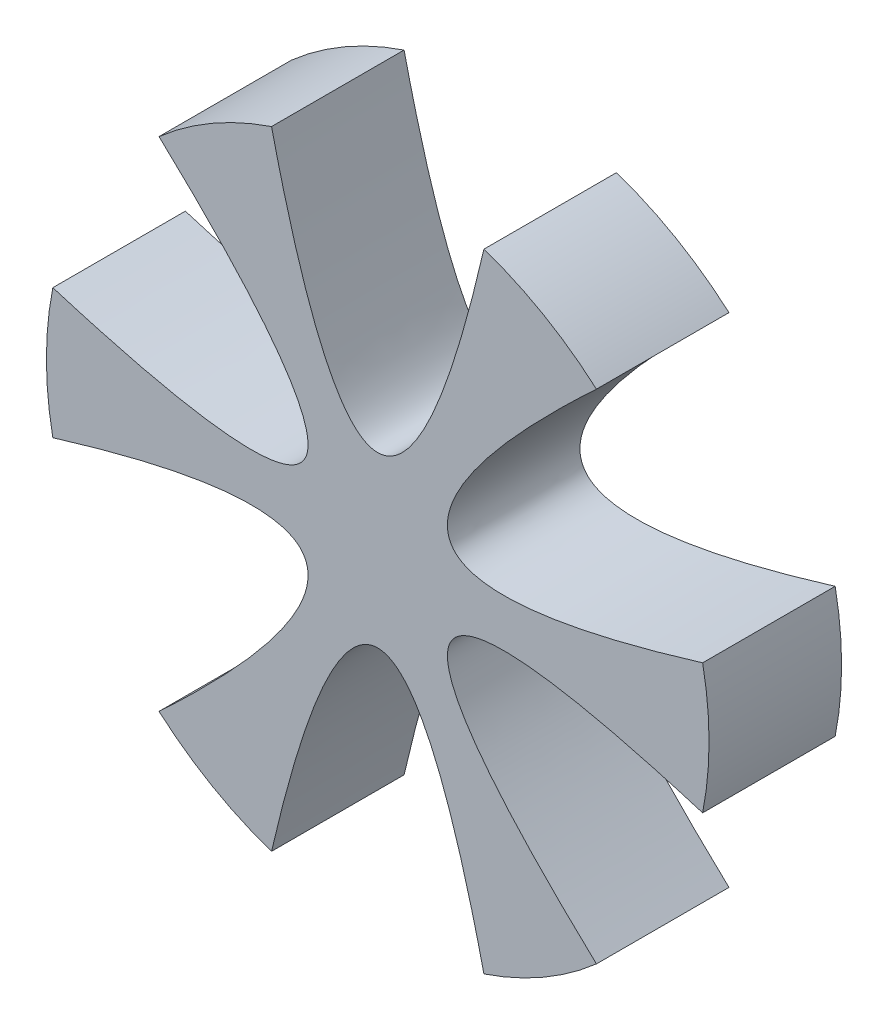
ISO-10303-21;
HEADER;
FILE_DESCRIPTION(('STEP AP214'),'2;1');
FILE_NAME('part.step','',(''),(''),'','','');
FILE_SCHEMA(('AUTOMOTIVE_DESIGN { 1 0 10303 214 1 1 1 1 }'));
ENDSEC;
DATA;
#1=APPLICATION_CONTEXT('core data for automotive mechanical design processes');
#2=APPLICATION_PROTOCOL_DEFINITION('international standard','automotive_design',2000,#1);
#3=PRODUCT_CONTEXT('',#1,'mechanical');
#4=PRODUCT('Part','Part','',(#3));
#5=PRODUCT_RELATED_PRODUCT_CATEGORY('part','',(#4));
#6=PRODUCT_DEFINITION_FORMATION('','',#4);
#7=PRODUCT_DEFINITION_CONTEXT('part definition',#1,'design');
#8=PRODUCT_DEFINITION('design','',#6,#7);
#9=PRODUCT_DEFINITION_SHAPE('','',#8);
#10=(LENGTH_UNIT() NAMED_UNIT(*) SI_UNIT(.MILLI.,.METRE.));
#11=(NAMED_UNIT(*) PLANE_ANGLE_UNIT() SI_UNIT($,.RADIAN.));
#12=(NAMED_UNIT(*) SI_UNIT($,.STERADIAN.) SOLID_ANGLE_UNIT());
#13=UNCERTAINTY_MEASURE_WITH_UNIT(LENGTH_MEASURE(1.E-05),#10,'distance_accuracy_value','');
#14=(GEOMETRIC_REPRESENTATION_CONTEXT(3) GLOBAL_UNCERTAINTY_ASSIGNED_CONTEXT((#13)) GLOBAL_UNIT_ASSIGNED_CONTEXT((#10,
#11,#12)) REPRESENTATION_CONTEXT('',''));
#15=CARTESIAN_POINT('',(0.,0.,0.));
#16=DIRECTION('',(0.,0.,1.));
#17=DIRECTION('',(1.,0.,0.));
#18=AXIS2_PLACEMENT_3D('',#15,#16,#17);
#19=CARTESIAN_POINT('',(0.,0.,2.54));
#20=DIRECTION('',(0.,0.,-1.));
#21=DIRECTION('',(-1.,0.,0.));
#22=AXIS2_PLACEMENT_3D('',#19,#20,#21);
#23=CYLINDRICAL_SURFACE('',#22,38.1);
#24=CARTESIAN_POINT('',(0.,0.,0.));
#25=DIRECTION('',(0.,0.,1.));
#26=DIRECTION('',(1.,0.,0.));
#27=AXIS2_PLACEMENT_3D('',#24,#25,#26);
#28=CIRCLE('',#27,38.1);
#29=CARTESIAN_POINT('',(-12.2104215859481,36.0903810549766,0.));
#30=VERTEX_POINT('',#29);
#31=CARTESIAN_POINT('',(-25.1499760328959,28.6197258118375,0.));
#32=VERTEX_POINT('',#31);
#33=EDGE_CURVE('E176',#30,#32,#28,.T.);
#34=ORIENTED_EDGE('',*,*,#33,.T.);
#35=DIRECTION('',(0.,0.,-1.));
#36=VECTOR('',#35,1.);
#37=CARTESIAN_POINT('',(-25.1499760328959,28.6197258118375,15.24));
#38=LINE('',#37,#36);
#39=CARTESIAN_POINT('',(-25.1499760328959,28.6197258118375,15.24));
#40=VERTEX_POINT('',#39);
#41=EDGE_CURVE('E285',#40,#32,#38,.T.);
#42=ORIENTED_EDGE('',*,*,#41,.F.);
#43=CARTESIAN_POINT('',(0.,0.,15.24));
#44=DIRECTION('',(0.,0.,1.));
#45=DIRECTION('',(1.,0.,0.));
#46=AXIS2_PLACEMENT_3D('',#43,#44,#45);
#47=CIRCLE('',#46,38.1);
#48=CARTESIAN_POINT('',(-12.2104215859481,36.0903810549766,15.24));
#49=VERTEX_POINT('',#48);
#50=EDGE_CURVE('E375',#49,#40,#47,.T.);
#51=ORIENTED_EDGE('',*,*,#50,.F.);
#52=DIRECTION('',(0.,0.,-1.));
#53=VECTOR('',#52,1.);
#54=CARTESIAN_POINT('',(-12.2104215859481,36.0903810549766,15.24));
#55=LINE('',#54,#53);
#56=EDGE_CURVE('E283',#49,#30,#55,.T.);
#57=ORIENTED_EDGE('',*,*,#56,.T.);
#58=EDGE_LOOP('',(#34,#42,#51,#57));
#59=FACE_BOUND('',#58,.T.);
#60=ADVANCED_FACE('F168',(#59),#23,.T.);
#61=DIRECTION('',(0.,0.,-1.));
#62=VECTOR('',#61,1.);
#63=CARTESIAN_POINT('',(-37.3603976188443,7.47065524313977,15.24));
#64=LINE('',#63,#62);
#65=CARTESIAN_POINT('',(-37.3603976188443,7.47065524313977,15.24));
#66=VERTEX_POINT('',#65);
#67=CARTESIAN_POINT('',(-37.3603976188443,7.47065524313977,0.));
#68=VERTEX_POINT('',#67);
#69=EDGE_CURVE('E290',#66,#68,#64,.T.);
#70=ORIENTED_EDGE('',*,*,#69,.T.);
#71=CARTESIAN_POINT('',(-37.3603976188445,-7.47065524313899,0.));
#72=VERTEX_POINT('',#71);
#73=EDGE_CURVE('E446',#68,#72,#28,.T.);
#74=ORIENTED_EDGE('',*,*,#73,.T.);
#75=DIRECTION('',(0.,0.,-1.));
#76=VECTOR('',#75,1.);
#77=CARTESIAN_POINT('',(-37.3603976188445,-7.47065524313898,15.24));
#78=LINE('',#77,#76);
#79=CARTESIAN_POINT('',(-37.3603976188445,-7.47065524313898,15.24));
#80=VERTEX_POINT('',#79);
#81=EDGE_CURVE('E294',#80,#72,#78,.T.);
#82=ORIENTED_EDGE('',*,*,#81,.F.);
#83=CARTESIAN_POINT('',(0.,0.,15.24));
#84=DIRECTION('',(0.,0.,1.));
#85=DIRECTION('',(1.,0.,0.));
#86=AXIS2_PLACEMENT_3D('',#83,#84,#85);
#87=CIRCLE('',#86,38.1);
#88=EDGE_CURVE('E355',#66,#80,#87,.T.);
#89=ORIENTED_EDGE('',*,*,#88,.F.);
#90=EDGE_LOOP('',(#70,#74,#82,#89));
#91=FACE_BOUND('',#90,.T.);
#92=ADVANCED_FACE('F471',(#91),#23,.T.);
#93=DIRECTION('',(0.,0.,-1.));
#94=VECTOR('',#93,1.);
#95=CARTESIAN_POINT('',(-25.1499760328965,-28.619725811837,15.24));
#96=LINE('',#95,#94);
#97=CARTESIAN_POINT('',(-25.1499760328965,-28.619725811837,15.24));
#98=VERTEX_POINT('',#97);
#99=CARTESIAN_POINT('',(-25.1499760328965,-28.619725811837,0.));
#100=VERTEX_POINT('',#99);
#101=EDGE_CURVE('E296',#98,#100,#96,.T.);
#102=ORIENTED_EDGE('',*,*,#101,.T.);
#103=CARTESIAN_POINT('',(-12.2104215859484,-36.0903810549765,0.));
#104=VERTEX_POINT('',#103);
#105=EDGE_CURVE('E284',#100,#104,#28,.T.);
#106=ORIENTED_EDGE('',*,*,#105,.T.);
#107=DIRECTION('',(0.,0.,-1.));
#108=VECTOR('',#107,1.);
#109=CARTESIAN_POINT('',(-12.2104215859484,-36.0903810549765,15.24));
#110=LINE('',#109,#108);
#111=CARTESIAN_POINT('',(-12.2104215859484,-36.0903810549765,15.24));
#112=VERTEX_POINT('',#111);
#113=EDGE_CURVE('E191',#112,#104,#110,.T.);
#114=ORIENTED_EDGE('',*,*,#113,.F.);
#115=CARTESIAN_POINT('',(0.,0.,15.24));
#116=DIRECTION('',(0.,0.,1.));
#117=DIRECTION('',(1.,0.,0.));
#118=AXIS2_PLACEMENT_3D('',#115,#116,#117);
#119=CIRCLE('',#118,38.1);
#120=EDGE_CURVE('E345',#98,#112,#119,.T.);
#121=ORIENTED_EDGE('',*,*,#120,.F.);
#122=EDGE_LOOP('',(#102,#106,#114,#121));
#123=FACE_BOUND('',#122,.T.);
#124=ADVANCED_FACE('F444',(#123),#23,.T.);
#125=CARTESIAN_POINT('',(37.3603976188444,-7.47065524313953,0.));
#126=VERTEX_POINT('',#125);
#127=CARTESIAN_POINT('',(37.3603976188444,7.47065524313925,0.));
#128=VERTEX_POINT('',#127);
#129=EDGE_CURVE('E171',#126,#128,#28,.T.);
#130=ORIENTED_EDGE('',*,*,#129,.T.);
#131=DIRECTION('',(0.,0.,-1.));
#132=VECTOR('',#131,1.);
#133=CARTESIAN_POINT('',(37.3603976188444,7.47065524313926,15.24));
#134=LINE('',#133,#132);
#135=CARTESIAN_POINT('',(37.3603976188444,7.47065524313926,15.24));
#136=VERTEX_POINT('',#135);
#137=EDGE_CURVE('E267',#136,#128,#134,.T.);
#138=ORIENTED_EDGE('',*,*,#137,.F.);
#139=CARTESIAN_POINT('',(0.,0.,15.24));
#140=DIRECTION('',(0.,0.,1.));
#141=DIRECTION('',(1.,0.,0.));
#142=AXIS2_PLACEMENT_3D('',#139,#140,#141);
#143=CIRCLE('',#142,38.1);
#144=CARTESIAN_POINT('',(37.3603976188444,-7.47065524313951,15.24));
#145=VERTEX_POINT('',#144);
#146=EDGE_CURVE('E266',#145,#136,#143,.T.);
#147=ORIENTED_EDGE('',*,*,#146,.F.);
#148=DIRECTION('',(0.,0.,-1.));
#149=VECTOR('',#148,1.);
#150=CARTESIAN_POINT('',(37.3603976188444,-7.47065524313951,15.24));
#151=LINE('',#150,#149);
#152=EDGE_CURVE('E262',#145,#126,#151,.T.);
#153=ORIENTED_EDGE('',*,*,#152,.T.);
#154=EDGE_LOOP('',(#130,#138,#147,#153));
#155=FACE_BOUND('',#154,.T.);
#156=ADVANCED_FACE('F263',(#155),#23,.T.);
#157=DIRECTION('',(0.,0.,-1.));
#158=VECTOR('',#157,1.);
#159=CARTESIAN_POINT('',(25.1499760328963,28.6197258118372,15.24));
#160=LINE('',#159,#158);
#161=CARTESIAN_POINT('',(25.1499760328963,28.6197258118372,15.24));
#162=VERTEX_POINT('',#161);
#163=CARTESIAN_POINT('',(25.1499760328963,28.6197258118372,0.));
#164=VERTEX_POINT('',#163);
#165=EDGE_CURVE('E303',#162,#164,#160,.T.);
#166=ORIENTED_EDGE('',*,*,#165,.T.);
#167=CARTESIAN_POINT('',(12.2104215859481,36.0903810549766,0.));
#168=VERTEX_POINT('',#167);
#169=EDGE_CURVE('E12',#164,#168,#28,.T.);
#170=ORIENTED_EDGE('',*,*,#169,.T.);
#171=DIRECTION('',(0.,0.,-1.));
#172=VECTOR('',#171,1.);
#173=CARTESIAN_POINT('',(12.2104215859481,36.0903810549766,15.24));
#174=LINE('',#173,#172);
#175=CARTESIAN_POINT('',(12.2104215859481,36.0903810549766,15.24));
#176=VERTEX_POINT('',#175);
#177=EDGE_CURVE('E305',#176,#168,#174,.T.);
#178=ORIENTED_EDGE('',*,*,#177,.F.);
#179=CARTESIAN_POINT('',(0.,0.,15.24));
#180=DIRECTION('',(0.,0.,1.));
#181=DIRECTION('',(1.,0.,0.));
#182=AXIS2_PLACEMENT_3D('',#179,#180,#181);
#183=CIRCLE('',#182,38.1);
#184=EDGE_CURVE('E307',#162,#176,#183,.T.);
#185=ORIENTED_EDGE('',*,*,#184,.F.);
#186=EDGE_LOOP('',(#166,#170,#178,#185));
#187=FACE_BOUND('',#186,.T.);
#188=ADVANCED_FACE('F462',(#187),#23,.T.);
#189=DIRECTION('',(0.,0.,-1.));
#190=VECTOR('',#189,1.);
#191=CARTESIAN_POINT('',(12.2104215859479,-36.0903810549767,15.24));
#192=LINE('',#191,#190);
#193=CARTESIAN_POINT('',(12.2104215859479,-36.0903810549767,15.24));
#194=VERTEX_POINT('',#193);
#195=CARTESIAN_POINT('',(12.2104215859479,-36.0903810549767,0.));
#196=VERTEX_POINT('',#195);
#197=EDGE_CURVE('E299',#194,#196,#192,.T.);
#198=ORIENTED_EDGE('',*,*,#197,.T.);
#199=CARTESIAN_POINT('',(25.1499760328961,-28.6197258118374,0.));
#200=VERTEX_POINT('',#199);
#201=EDGE_CURVE('E282',#196,#200,#28,.T.);
#202=ORIENTED_EDGE('',*,*,#201,.T.);
#203=DIRECTION('',(0.,0.,-1.));
#204=VECTOR('',#203,1.);
#205=CARTESIAN_POINT('',(25.1499760328961,-28.6197258118374,15.24));
#206=LINE('',#205,#204);
#207=CARTESIAN_POINT('',(25.1499760328961,-28.6197258118374,15.24));
#208=VERTEX_POINT('',#207);
#209=EDGE_CURVE('E183',#208,#200,#206,.T.);
#210=ORIENTED_EDGE('',*,*,#209,.F.);
#211=CARTESIAN_POINT('',(0.,0.,15.24));
#212=DIRECTION('',(0.,0.,1.));
#213=DIRECTION('',(1.,0.,0.));
#214=AXIS2_PLACEMENT_3D('',#211,#212,#213);
#215=CIRCLE('',#214,38.1);
#216=EDGE_CURVE('E336',#194,#208,#215,.T.);
#217=ORIENTED_EDGE('',*,*,#216,.F.);
#218=EDGE_LOOP('',(#198,#202,#210,#217));
#219=FACE_BOUND('',#218,.T.);
#220=ADVANCED_FACE('F438',(#219),#23,.T.);
#221=CARTESIAN_POINT('',(0.,0.,0.));
#222=DIRECTION('',(0.,0.,1.));
#223=DIRECTION('',(1.,0.,0.));
#224=AXIS2_PLACEMENT_3D('',#221,#222,#223);
#225=PLANE('',#224);
#226=CARTESIAN_POINT('',(0.,0.,0.));
#227=DIRECTION('',(0.,0.,-1.));
#228=DIRECTION('',(-1.,0.,0.));
#229=AXIS2_PLACEMENT_3D('',#226,#227,#228);
#230=CIRCLE('',#229,1.524);
#231=CARTESIAN_POINT('',(-1.524,0.,0.));
#232=VERTEX_POINT('',#231);
#233=EDGE_CURVE('E386',#232,#232,#230,.T.);
#234=ORIENTED_EDGE('',*,*,#233,.F.);
#235=EDGE_LOOP('',(#234));
#236=FACE_BOUND('',#235,.T.);
#237=CARTESIAN_POINT('',(-25.149976032896,28.6197258118376,0.));
#238=CARTESIAN_POINT('',(14.4118690297218,-8.32069646383576,0.));
#239=CARTESIAN_POINT('',(-37.3603976188443,7.47065524313977,0.));
#240=B_SPLINE_CURVE_WITH_KNOTS('',2,(#237,#238,#239),.UNSPECIFIED.,.F.,.F.,(3,3),(0.,1.),.UNSPECIFIED.);
#241=EDGE_CURVE('E392',#32,#68,#240,.T.);
#242=ORIENTED_EDGE('',*,*,#241,.F.);
#243=ORIENTED_EDGE('',*,*,#33,.F.);
#244=CARTESIAN_POINT('',(12.2104215859481,36.0903810549766,0.));
#245=CARTESIAN_POINT('',(0.,-16.6413929276712,0.));
#246=CARTESIAN_POINT('',(-12.2104215859481,36.0903810549766,0.));
#247=B_SPLINE_CURVE_WITH_KNOTS('',2,(#244,#245,#246),.UNSPECIFIED.,.F.,.F.,(3,3),(0.,1.),.UNSPECIFIED.);
#248=EDGE_CURVE('E413',#168,#30,#247,.T.);
#249=ORIENTED_EDGE('',*,*,#248,.F.);
#250=ORIENTED_EDGE('',*,*,#169,.F.);
#251=CARTESIAN_POINT('',(37.3603976188444,7.47065524313924,0.));
#252=CARTESIAN_POINT('',(-14.4118690297219,-8.32069646383555,0.));
#253=CARTESIAN_POINT('',(25.1499760328963,28.6197258118372,0.));
#254=B_SPLINE_CURVE_WITH_KNOTS('',2,(#251,#252,#253),.UNSPECIFIED.,.F.,.F.,(3,3),(0.,1.),.UNSPECIFIED.);
#255=EDGE_CURVE('E281',#128,#164,#254,.T.);
#256=ORIENTED_EDGE('',*,*,#255,.F.);
#257=ORIENTED_EDGE('',*,*,#129,.F.);
#258=CARTESIAN_POINT('',(25.1499760328961,-28.6197258118374,0.));
#259=CARTESIAN_POINT('',(-14.4118690297219,8.32069646383565,0.));
#260=CARTESIAN_POINT('',(37.3603976188444,-7.47065524313951,0.));
#261=B_SPLINE_CURVE_WITH_KNOTS('',2,(#258,#259,#260),.UNSPECIFIED.,.F.,.F.,(3,3),(0.,1.),.UNSPECIFIED.);
#262=EDGE_CURVE('E269',#200,#126,#261,.T.);
#263=ORIENTED_EDGE('',*,*,#262,.F.);
#264=ORIENTED_EDGE('',*,*,#201,.F.);
#265=CARTESIAN_POINT('',(-12.2104215859484,-36.0903810549765,0.));
#266=CARTESIAN_POINT('',(1.15779239494296E-13,16.6413929276712,0.));
#267=CARTESIAN_POINT('',(12.2104215859479,-36.0903810549767,0.));
#268=B_SPLINE_CURVE_WITH_KNOTS('',2,(#265,#266,#267),.UNSPECIFIED.,.F.,.F.,(3,3),(0.,1.),.UNSPECIFIED.);
#269=EDGE_CURVE('E274',#104,#196,#268,.T.);
#270=ORIENTED_EDGE('',*,*,#269,.F.);
#271=ORIENTED_EDGE('',*,*,#105,.F.);
#272=CARTESIAN_POINT('',(-37.3603976188445,-7.47065524313899,0.));
#273=CARTESIAN_POINT('',(14.411869029722,8.32069646383545,0.));
#274=CARTESIAN_POINT('',(-25.1499760328965,-28.619725811837,0.));
#275=B_SPLINE_CURVE_WITH_KNOTS('',2,(#272,#273,#274),.UNSPECIFIED.,.F.,.F.,(3,3),(0.,1.),.UNSPECIFIED.);
#276=EDGE_CURVE('E399',#72,#100,#275,.T.);
#277=ORIENTED_EDGE('',*,*,#276,.F.);
#278=ORIENTED_EDGE('',*,*,#73,.F.);
#279=EDGE_LOOP('',(#242,#243,#249,#250,#256,#257,#263,#264,#270,#271,#277,#278));
#280=FACE_BOUND('',#279,.T.);
#281=ADVANCED_FACE('F278',(#236,#280),#225,.F.);
#282=CARTESIAN_POINT('',(12.2104215859481,36.0903810549766,15.24));
#283=CARTESIAN_POINT('',(0.,-16.6413929276712,15.24));
#284=CARTESIAN_POINT('',(-12.2104215859481,36.0903810549766,15.24));
#285=B_SPLINE_CURVE_WITH_KNOTS('',2,(#282,#283,#284),.UNSPECIFIED.,.F.,.F.,(3,3),(0.,1.),.UNSPECIFIED.);
#286=DIRECTION('',(0.,0.,-1.));
#287=VECTOR('',#286,1.);
#288=SURFACE_OF_LINEAR_EXTRUSION('',#285,#287);
#289=ORIENTED_EDGE('',*,*,#177,.T.);
#290=ORIENTED_EDGE('',*,*,#248,.T.);
#291=ORIENTED_EDGE('',*,*,#56,.F.);
#292=EDGE_CURVE('E379',#176,#49,#285,.T.);
#293=ORIENTED_EDGE('',*,*,#292,.F.);
#294=EDGE_LOOP('',(#289,#290,#291,#293));
#295=FACE_BOUND('',#294,.T.);
#296=ADVANCED_FACE('F367',(#295),#288,.F.);
#297=CARTESIAN_POINT('',(-25.149976032896,28.6197258118376,15.24));
#298=CARTESIAN_POINT('',(14.4118690297218,-8.32069646383576,15.24));
#299=CARTESIAN_POINT('',(-37.3603976188443,7.47065524313977,15.24));
#300=B_SPLINE_CURVE_WITH_KNOTS('',2,(#297,#298,#299),.UNSPECIFIED.,.F.,.F.,(3,3),(0.,1.),.UNSPECIFIED.);
#301=DIRECTION('',(0.,0.,-1.));
#302=VECTOR('',#301,1.);
#303=SURFACE_OF_LINEAR_EXTRUSION('',#300,#302);
#304=ORIENTED_EDGE('',*,*,#41,.T.);
#305=ORIENTED_EDGE('',*,*,#241,.T.);
#306=ORIENTED_EDGE('',*,*,#69,.F.);
#307=EDGE_CURVE('E370',#40,#66,#300,.T.);
#308=ORIENTED_EDGE('',*,*,#307,.F.);
#309=EDGE_LOOP('',(#304,#305,#306,#308));
#310=FACE_BOUND('',#309,.T.);
#311=ADVANCED_FACE('F363',(#310),#303,.F.);
#312=CARTESIAN_POINT('',(-37.3603976188445,-7.47065524313899,15.24));
#313=CARTESIAN_POINT('',(14.411869029722,8.32069646383545,15.24));
#314=CARTESIAN_POINT('',(-25.1499760328965,-28.619725811837,15.24));
#315=B_SPLINE_CURVE_WITH_KNOTS('',2,(#312,#313,#314),.UNSPECIFIED.,.F.,.F.,(3,3),(0.,1.),.UNSPECIFIED.);
#316=DIRECTION('',(0.,0.,-1.));
#317=VECTOR('',#316,1.);
#318=SURFACE_OF_LINEAR_EXTRUSION('',#315,#317);
#319=ORIENTED_EDGE('',*,*,#81,.T.);
#320=ORIENTED_EDGE('',*,*,#276,.T.);
#321=ORIENTED_EDGE('',*,*,#101,.F.);
#322=EDGE_CURVE('E350',#80,#98,#315,.T.);
#323=ORIENTED_EDGE('',*,*,#322,.F.);
#324=EDGE_LOOP('',(#319,#320,#321,#323));
#325=FACE_BOUND('',#324,.T.);
#326=ADVANCED_FACE('F360',(#325),#318,.F.);
#327=CARTESIAN_POINT('',(-12.2104215859484,-36.0903810549765,15.24));
#328=CARTESIAN_POINT('',(1.15779239494296E-13,16.6413929276712,15.24));
#329=CARTESIAN_POINT('',(12.2104215859479,-36.0903810549767,15.24));
#330=B_SPLINE_CURVE_WITH_KNOTS('',2,(#327,#328,#329),.UNSPECIFIED.,.F.,.F.,(3,3),(0.,1.),.UNSPECIFIED.);
#331=DIRECTION('',(0.,0.,-1.));
#332=VECTOR('',#331,1.);
#333=SURFACE_OF_LINEAR_EXTRUSION('',#330,#332);
#334=ORIENTED_EDGE('',*,*,#113,.T.);
#335=ORIENTED_EDGE('',*,*,#269,.T.);
#336=ORIENTED_EDGE('',*,*,#197,.F.);
#337=EDGE_CURVE('E340',#112,#194,#330,.T.);
#338=ORIENTED_EDGE('',*,*,#337,.F.);
#339=EDGE_LOOP('',(#334,#335,#336,#338));
#340=FACE_BOUND('',#339,.T.);
#341=ADVANCED_FACE('F328',(#340),#333,.F.);
#342=CARTESIAN_POINT('',(25.1499760328961,-28.6197258118374,15.24));
#343=CARTESIAN_POINT('',(-14.4118690297219,8.32069646383565,15.24));
#344=CARTESIAN_POINT('',(37.3603976188444,-7.47065524313951,15.24));
#345=B_SPLINE_CURVE_WITH_KNOTS('',2,(#342,#343,#344),.UNSPECIFIED.,.F.,.F.,(3,3),(0.,1.),.UNSPECIFIED.);
#346=DIRECTION('',(0.,0.,-1.));
#347=VECTOR('',#346,1.);
#348=SURFACE_OF_LINEAR_EXTRUSION('',#345,#347);
#349=ORIENTED_EDGE('',*,*,#209,.T.);
#350=ORIENTED_EDGE('',*,*,#262,.T.);
#351=ORIENTED_EDGE('',*,*,#152,.F.);
#352=EDGE_CURVE('E331',#208,#145,#345,.T.);
#353=ORIENTED_EDGE('',*,*,#352,.F.);
#354=EDGE_LOOP('',(#349,#350,#351,#353));
#355=FACE_BOUND('',#354,.T.);
#356=ADVANCED_FACE('F270',(#355),#348,.F.);
#357=CARTESIAN_POINT('',(37.3603976188444,7.47065524313924,15.24));
#358=CARTESIAN_POINT('',(-14.4118690297219,-8.32069646383555,15.24));
#359=CARTESIAN_POINT('',(25.1499760328963,28.6197258118372,15.24));
#360=B_SPLINE_CURVE_WITH_KNOTS('',2,(#357,#358,#359),.UNSPECIFIED.,.F.,.F.,(3,3),(0.,1.),.UNSPECIFIED.);
#361=DIRECTION('',(0.,0.,-1.));
#362=VECTOR('',#361,1.);
#363=SURFACE_OF_LINEAR_EXTRUSION('',#360,#362);
#364=ORIENTED_EDGE('',*,*,#137,.T.);
#365=ORIENTED_EDGE('',*,*,#255,.T.);
#366=ORIENTED_EDGE('',*,*,#165,.F.);
#367=EDGE_CURVE('E309',#136,#162,#360,.T.);
#368=ORIENTED_EDGE('',*,*,#367,.F.);
#369=EDGE_LOOP('',(#364,#365,#366,#368));
#370=FACE_BOUND('',#369,.T.);
#371=ADVANCED_FACE('F319',(#370),#363,.F.);
#372=CARTESIAN_POINT('',(0.,9.7244940636527,15.24));
#373=DIRECTION('',(0.,0.,-1.));
#374=DIRECTION('',(-1.,0.,0.));
#375=AXIS2_PLACEMENT_3D('',#372,#373,#374);
#376=PLANE('',#375);
#377=ORIENTED_EDGE('',*,*,#292,.T.);
#378=ORIENTED_EDGE('',*,*,#50,.T.);
#379=ORIENTED_EDGE('',*,*,#307,.T.);
#380=ORIENTED_EDGE('',*,*,#88,.T.);
#381=ORIENTED_EDGE('',*,*,#322,.T.);
#382=ORIENTED_EDGE('',*,*,#120,.T.);
#383=ORIENTED_EDGE('',*,*,#337,.T.);
#384=ORIENTED_EDGE('',*,*,#216,.T.);
#385=ORIENTED_EDGE('',*,*,#352,.T.);
#386=ORIENTED_EDGE('',*,*,#146,.T.);
#387=ORIENTED_EDGE('',*,*,#367,.T.);
#388=ORIENTED_EDGE('',*,*,#184,.T.);
#389=EDGE_LOOP('',(#377,#378,#379,#380,#381,#382,#383,#384,#385,#386,#387,#388));
#390=FACE_BOUND('',#389,.T.);
#391=ADVANCED_FACE('F323',(#390),#376,.F.);
#392=CARTESIAN_POINT('',(0.,0.,3.80999999999999));
#393=DIRECTION('',(0.,0.,-1.));
#394=DIRECTION('',(-1.,0.,0.));
#395=AXIS2_PLACEMENT_3D('',#392,#393,#394);
#396=CYLINDRICAL_SURFACE('',#395,1.524);
#397=CARTESIAN_POINT('',(0.,0.,3.80999999999999));
#398=DIRECTION('',(0.,0.,-1.));
#399=DIRECTION('',(-1.,0.,0.));
#400=AXIS2_PLACEMENT_3D('',#397,#398,#399);
#401=CIRCLE('',#400,1.524);
#402=CARTESIAN_POINT('',(-1.524,0.,3.80999999999999));
#403=VERTEX_POINT('',#402);
#404=EDGE_CURVE('E385',#403,#403,#401,.T.);
#405=CARTESIAN_POINT('',(-1.524,0.,3.80999999999999));
#406=CARTESIAN_POINT('',(-1.524,0.,3.77031249999999));
#407=CARTESIAN_POINT('',(-1.524,0.,3.73062499999999));
#408=CARTESIAN_POINT('',(-1.524,0.,3.65124999999999));
#409=CARTESIAN_POINT('',(-1.524,0.,3.61156249999999));
#410=CARTESIAN_POINT('',(-1.524,0.,3.53218749999999));
#411=CARTESIAN_POINT('',(-1.524,0.,3.49249999999999));
#412=CARTESIAN_POINT('',(-1.524,0.,3.41312499999999));
#413=CARTESIAN_POINT('',(-1.524,0.,3.37343749999999));
#414=CARTESIAN_POINT('',(-1.524,0.,3.29406249999999));
#415=CARTESIAN_POINT('',(-1.524,0.,3.25437499999999));
#416=CARTESIAN_POINT('',(-1.524,0.,3.17499999999999));
#417=CARTESIAN_POINT('',(-1.524,0.,3.13531249999999));
#418=CARTESIAN_POINT('',(-1.524,0.,3.05593749999999));
#419=CARTESIAN_POINT('',(-1.524,0.,3.01624999999999));
#420=CARTESIAN_POINT('',(-1.524,0.,2.93687499999999));
#421=CARTESIAN_POINT('',(-1.524,0.,2.89718749999999));
#422=CARTESIAN_POINT('',(-1.524,0.,2.81781249999999));
#423=CARTESIAN_POINT('',(-1.524,0.,2.77812499999999));
#424=CARTESIAN_POINT('',(-1.524,0.,2.69875));
#425=CARTESIAN_POINT('',(-1.524,0.,2.65906249999999));
#426=CARTESIAN_POINT('',(-1.524,0.,2.5796875));
#427=CARTESIAN_POINT('',(-1.524,0.,2.54));
#428=CARTESIAN_POINT('',(-1.524,0.,2.460625));
#429=CARTESIAN_POINT('',(-1.524,0.,2.4209375));
#430=CARTESIAN_POINT('',(-1.524,0.,2.3415625));
#431=CARTESIAN_POINT('',(-1.524,0.,2.301875));
#432=CARTESIAN_POINT('',(-1.524,0.,2.2225));
#433=CARTESIAN_POINT('',(-1.524,0.,2.1828125));
#434=CARTESIAN_POINT('',(-1.524,0.,2.1034375));
#435=CARTESIAN_POINT('',(-1.524,0.,2.06375));
#436=CARTESIAN_POINT('',(-1.524,0.,1.984375));
#437=CARTESIAN_POINT('',(-1.524,0.,1.9446875));
#438=CARTESIAN_POINT('',(-1.524,0.,1.8653125));
#439=CARTESIAN_POINT('',(-1.524,0.,1.825625));
#440=CARTESIAN_POINT('',(-1.524,0.,1.74625));
#441=CARTESIAN_POINT('',(-1.524,0.,1.7065625));
#442=CARTESIAN_POINT('',(-1.524,0.,1.6271875));
#443=CARTESIAN_POINT('',(-1.524,0.,1.5875));
#444=CARTESIAN_POINT('',(-1.524,0.,1.508125));
#445=CARTESIAN_POINT('',(-1.524,0.,1.4684375));
#446=CARTESIAN_POINT('',(-1.524,0.,1.3890625));
#447=CARTESIAN_POINT('',(-1.524,0.,1.349375));
#448=CARTESIAN_POINT('',(-1.524,0.,1.27));
#449=CARTESIAN_POINT('',(-1.524,0.,1.2303125));
#450=CARTESIAN_POINT('',(-1.524,0.,1.1509375));
#451=CARTESIAN_POINT('',(-1.524,0.,1.11125));
#452=CARTESIAN_POINT('',(-1.524,0.,1.031875));
#453=CARTESIAN_POINT('',(-1.524,0.,0.992187499999998));
#454=CARTESIAN_POINT('',(-1.524,0.,0.912812499999999));
#455=CARTESIAN_POINT('',(-1.524,0.,0.873124999999999));
#456=CARTESIAN_POINT('',(-1.524,0.,0.793749999999999));
#457=CARTESIAN_POINT('',(-1.524,0.,0.754062499999999));
#458=CARTESIAN_POINT('',(-1.524,0.,0.674687499999999));
#459=CARTESIAN_POINT('',(-1.524,0.,0.634999999999999));
#460=CARTESIAN_POINT('',(-1.524,0.,0.555625));
#461=CARTESIAN_POINT('',(-1.524,0.,0.5159375));
#462=CARTESIAN_POINT('',(-1.524,0.,0.4365625));
#463=CARTESIAN_POINT('',(-1.524,0.,0.396875));
#464=CARTESIAN_POINT('',(-1.524,0.,0.3175));
#465=CARTESIAN_POINT('',(-1.524,0.,0.2778125));
#466=CARTESIAN_POINT('',(-1.524,0.,0.1984375));
#467=CARTESIAN_POINT('',(-1.524,0.,0.15875));
#468=CARTESIAN_POINT('',(-1.524,0.,0.0793750000000003));
#469=CARTESIAN_POINT('',(-1.524,0.,0.0396875000000003));
#470=CARTESIAN_POINT('',(-1.524,0.,0.));
#471=B_SPLINE_CURVE_WITH_KNOTS('',3,(#405,#406,#407,#408,#409,#410,#411,#412,#413,#414,#415,
#416,#417,#418,#419,#420,#421,#422,#423,#424,#425,#426,#427,#428,#429,#430,#431,#432,#433,#434,
#435,#436,#437,#438,#439,#440,#441,#442,#443,#444,#445,#446,#447,#448,#449,#450,#451,#452,#453,
#454,#455,#456,#457,#458,#459,#460,#461,#462,#463,#464,#465,#466,#467,#468,#469,#470),
.UNSPECIFIED.,.F.,.F.,(4,2,2,2,2,2,2,2,2,2,2,2,2,2,2,2,2,2,2,2,2,2,2,2,2,2,2,2,2,2,2,2,4),(0.,
0.1190625,0.238125,0.357187499999999,0.476249999999999,0.595312499999999,0.714374999999999,
0.833437499999999,0.952499999999998,1.0715625,1.190625,1.3096875,1.42875,1.5478125,1.666875,
1.7859375,1.905,2.0240625,2.143125,2.2621875,2.38124999999999,2.50031249999999,2.61937499999999,
2.73843749999999,2.85749999999999,2.97656249999999,3.09562499999999,3.21468749999999,
3.33374999999999,3.45281249999999,3.57187499999999,3.69093749999999,3.80999999999999),.UNSPECIFIED.);
#472=EDGE_CURVE('BSEAM563',#403,#232,#471,.T.);
#473=ORIENTED_EDGE('',*,*,#404,.F.);
#474=ORIENTED_EDGE('',*,*,#233,.T.);
#475=ORIENTED_EDGE('',*,*,#472,.T.);
#476=ORIENTED_EDGE('',*,*,#472,.F.);
#477=EDGE_LOOP('',(#473,#475,#474,#476));
#478=FACE_BOUND('',#477,.T.);
#479=ADVANCED_FACE('F563',(#478),#396,.F.);
#480=CARTESIAN_POINT('',(0.,0.,3.80999999999999));
#481=DIRECTION('',(0.,0.,-1.));
#482=DIRECTION('',(-1.,0.,0.));
#483=AXIS2_PLACEMENT_3D('',#480,#481,#482);
#484=PLANE('',#483);
#485=ORIENTED_EDGE('',*,*,#404,.T.);
#486=EDGE_LOOP('',(#485));
#487=FACE_BOUND('',#486,.T.);
#488=ADVANCED_FACE('F569',(#487),#484,.T.);
#489=CLOSED_SHELL('',(#60,#92,#124,#156,#188,#220,#281,#296,#311,#326,#341,#356,#371,#391,#479,#488));
#490=MANIFOLD_SOLID_BREP('B2',#489);
#491=ADVANCED_BREP_SHAPE_REPRESENTATION('',(#18,#490),#14);
#492=SHAPE_DEFINITION_REPRESENTATION(#9,#491);
ENDSEC;
END-ISO-10303-21;
